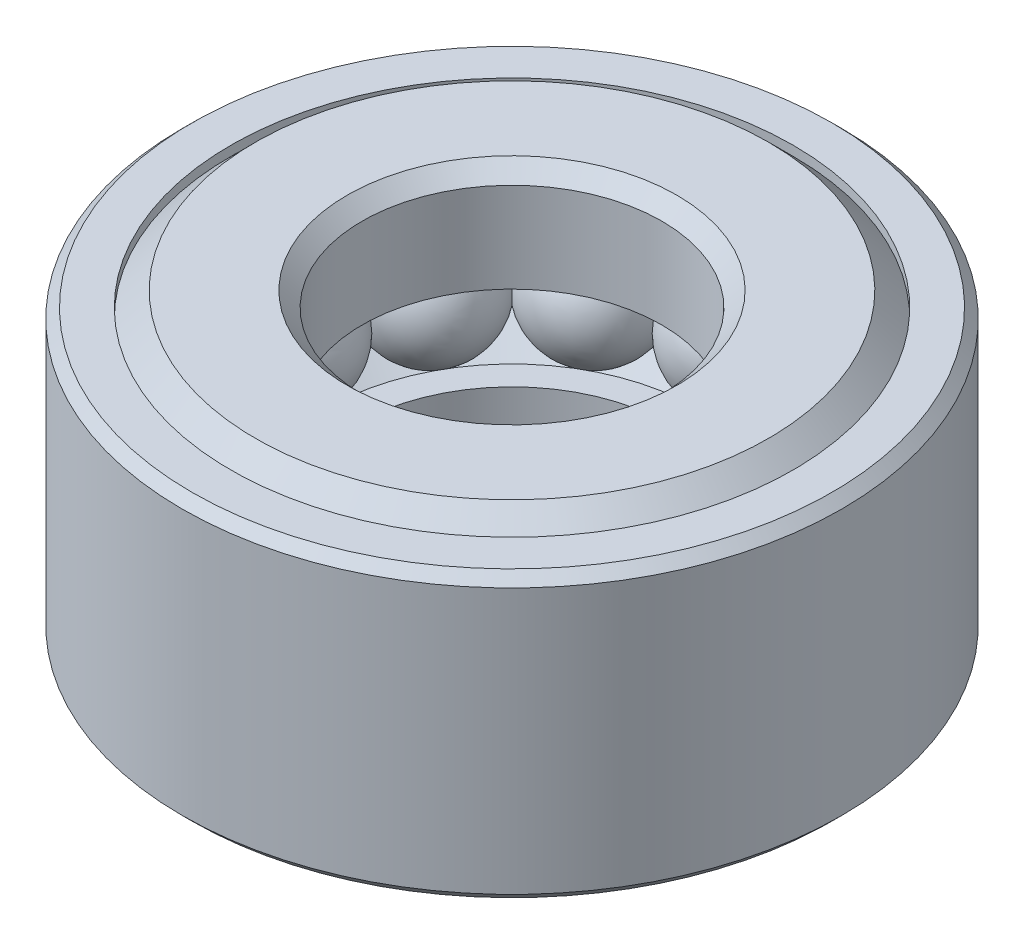
ISO-10303-21;
HEADER;
FILE_DESCRIPTION(('STEP AP214'),'2;1');
FILE_NAME('part.step','',(''),(''),'','','');
FILE_SCHEMA(('AUTOMOTIVE_DESIGN { 1 0 10303 214 1 1 1 1 }'));
ENDSEC;
DATA;
#1=APPLICATION_CONTEXT('core data for automotive mechanical design processes');
#2=APPLICATION_PROTOCOL_DEFINITION('international standard','automotive_design',2000,#1);
#3=PRODUCT_CONTEXT('',#1,'mechanical');
#4=PRODUCT('Part','Part','',(#3));
#5=PRODUCT_RELATED_PRODUCT_CATEGORY('part','',(#4));
#6=PRODUCT_DEFINITION_FORMATION('','',#4);
#7=PRODUCT_DEFINITION_CONTEXT('part definition',#1,'design');
#8=PRODUCT_DEFINITION('design','',#6,#7);
#9=PRODUCT_DEFINITION_SHAPE('','',#8);
#10=(LENGTH_UNIT() NAMED_UNIT(*) SI_UNIT(.MILLI.,.METRE.));
#11=(NAMED_UNIT(*) PLANE_ANGLE_UNIT() SI_UNIT($,.RADIAN.));
#12=(NAMED_UNIT(*) SI_UNIT($,.STERADIAN.) SOLID_ANGLE_UNIT());
#13=UNCERTAINTY_MEASURE_WITH_UNIT(LENGTH_MEASURE(1.E-05),#10,'distance_accuracy_value','');
#14=(GEOMETRIC_REPRESENTATION_CONTEXT(3) GLOBAL_UNCERTAINTY_ASSIGNED_CONTEXT((#13)) GLOBAL_UNIT_ASSIGNED_CONTEXT((#10,
#11,#12)) REPRESENTATION_CONTEXT('',''));
#15=CARTESIAN_POINT('',(0.,0.,0.));
#16=DIRECTION('',(0.,0.,1.));
#17=DIRECTION('',(1.,0.,0.));
#18=AXIS2_PLACEMENT_3D('',#15,#16,#17);
#19=CARTESIAN_POINT('',(0.,3.571875,7.44798137163755));
#20=DIRECTION('',(0.,-1.,0.));
#21=DIRECTION('',(0.,0.,-1.));
#22=AXIS2_PLACEMENT_3D('',#19,#20,#21);
#23=PLANE('',#22);
#24=CARTESIAN_POINT('',(0.,3.571875,0.));
#25=DIRECTION('',(0.,-1.,0.));
#26=DIRECTION('',(0.,0.,-1.));
#27=AXIS2_PLACEMENT_3D('',#24,#25,#26);
#28=CIRCLE('',#27,8.47484407539469);
#29=CARTESIAN_POINT('',(0.,3.571875,-8.47484407539469));
#30=VERTEX_POINT('',#29);
#31=EDGE_CURVE('E11',#30,#30,#28,.T.);
#32=ORIENTED_EDGE('',*,*,#31,.F.);
#33=EDGE_LOOP('',(#32));
#34=FACE_BOUND('',#33,.T.);
#35=CARTESIAN_POINT('',(0.,3.571875,0.));
#36=DIRECTION('',(0.,-1.,0.));
#37=DIRECTION('',(0.,0.,-1.));
#38=AXIS2_PLACEMENT_3D('',#35,#36,#37);
#39=CIRCLE('',#38,7.44798137163755);
#40=CARTESIAN_POINT('',(0.,3.571875,-7.44798137163755));
#41=VERTEX_POINT('',#40);
#42=EDGE_CURVE('E69',#41,#41,#39,.T.);
#43=ORIENTED_EDGE('',*,*,#42,.T.);
#44=EDGE_LOOP('',(#43));
#45=FACE_BOUND('',#44,.T.);
#46=ADVANCED_FACE('F41',(#34,#45),#23,.F.);
#47=CARTESIAN_POINT('',(0.,3.571875,0.));
#48=DIRECTION('',(0.,-1.,0.));
#49=DIRECTION('',(0.,0.,-1.));
#50=AXIS2_PLACEMENT_3D('',#47,#48,#49);
#51=CONICAL_SURFACE('',#50,8.47484407539469,0.78539816339745);
#52=CARTESIAN_POINT('',(0.,3.31546907539469,0.));
#53=DIRECTION('',(0.,-1.,0.));
#54=DIRECTION('',(0.,0.,-1.));
#55=AXIS2_PLACEMENT_3D('',#52,#53,#54);
#56=CIRCLE('',#55,8.73125);
#57=CARTESIAN_POINT('',(0.,3.31546907539469,-8.73125));
#58=VERTEX_POINT('',#57);
#59=EDGE_CURVE('E47',#58,#58,#56,.T.);
#60=ORIENTED_EDGE('',*,*,#59,.F.);
#61=EDGE_LOOP('',(#60));
#62=FACE_BOUND('',#61,.T.);
#63=ORIENTED_EDGE('',*,*,#31,.T.);
#64=EDGE_LOOP('',(#63));
#65=FACE_BOUND('',#64,.T.);
#66=ADVANCED_FACE('F106',(#62,#65),#51,.T.);
#67=CARTESIAN_POINT('',(0.,-3.96875,0.));
#68=DIRECTION('',(0.,-1.,0.));
#69=DIRECTION('',(0.,0.,-1.));
#70=AXIS2_PLACEMENT_3D('',#67,#68,#69);
#71=CYLINDRICAL_SURFACE('',#70,8.73125);
#72=CARTESIAN_POINT('',(0.,-3.71234407539469,0.));
#73=DIRECTION('',(0.,-1.,0.));
#74=DIRECTION('',(0.,0.,-1.));
#75=AXIS2_PLACEMENT_3D('',#72,#73,#74);
#76=CIRCLE('',#75,8.73125);
#77=CARTESIAN_POINT('',(0.,-3.71234407539469,-8.73125));
#78=VERTEX_POINT('',#77);
#79=EDGE_CURVE('E51',#78,#78,#76,.T.);
#80=ORIENTED_EDGE('',*,*,#79,.F.);
#81=EDGE_LOOP('',(#80));
#82=FACE_BOUND('',#81,.T.);
#83=ORIENTED_EDGE('',*,*,#59,.T.);
#84=EDGE_LOOP('',(#83));
#85=FACE_BOUND('',#84,.T.);
#86=ADVANCED_FACE('F101',(#82,#85),#71,.T.);
#87=CARTESIAN_POINT('',(0.,-3.71234407539469,0.));
#88=DIRECTION('',(0.,1.,0.));
#89=DIRECTION('',(0.,0.,1.));
#90=AXIS2_PLACEMENT_3D('',#87,#88,#89);
#91=CONICAL_SURFACE('',#90,8.73125,0.78539816339745);
#92=CARTESIAN_POINT('',(0.,-3.96875,0.));
#93=DIRECTION('',(0.,-1.,0.));
#94=DIRECTION('',(0.,0.,-1.));
#95=AXIS2_PLACEMENT_3D('',#92,#93,#94);
#96=CIRCLE('',#95,8.47484407539468);
#97=CARTESIAN_POINT('',(0.,-3.96875,-8.47484407539468));
#98=VERTEX_POINT('',#97);
#99=EDGE_CURVE('E55',#98,#98,#96,.T.);
#100=ORIENTED_EDGE('',*,*,#99,.F.);
#101=EDGE_LOOP('',(#100));
#102=FACE_BOUND('',#101,.T.);
#103=ORIENTED_EDGE('',*,*,#79,.T.);
#104=EDGE_LOOP('',(#103));
#105=FACE_BOUND('',#104,.T.);
#106=ADVANCED_FACE('F95',(#102,#105),#91,.T.);
#107=CARTESIAN_POINT('',(0.,-3.96875,8.47484407539468));
#108=DIRECTION('',(0.,1.,0.));
#109=DIRECTION('',(0.,0.,1.));
#110=AXIS2_PLACEMENT_3D('',#107,#108,#109);
#111=PLANE('',#110);
#112=CARTESIAN_POINT('',(0.,-3.96875,0.));
#113=DIRECTION('',(0.,-1.,0.));
#114=DIRECTION('',(0.,0.,-1.));
#115=AXIS2_PLACEMENT_3D('',#112,#113,#114);
#116=CIRCLE('',#115,8.03275);
#117=CARTESIAN_POINT('',(0.,-3.96875,-8.03275));
#118=VERTEX_POINT('',#117);
#119=EDGE_CURVE('E60',#118,#118,#116,.T.);
#120=ORIENTED_EDGE('',*,*,#119,.F.);
#121=EDGE_LOOP('',(#120));
#122=FACE_BOUND('',#121,.T.);
#123=ORIENTED_EDGE('',*,*,#99,.T.);
#124=EDGE_LOOP('',(#123));
#125=FACE_BOUND('',#124,.T.);
#126=ADVANCED_FACE('F89',(#122,#125),#111,.F.);
#127=CARTESIAN_POINT('',(0.,-3.96875,0.));
#128=DIRECTION('',(0.,-1.,0.));
#129=DIRECTION('',(0.,0.,-1.));
#130=AXIS2_PLACEMENT_3D('',#127,#128,#129);
#131=CYLINDRICAL_SURFACE('',#130,8.03275);
#132=CARTESIAN_POINT('',(0.,3.31546907539469,0.));
#133=DIRECTION('',(0.,-1.,0.));
#134=DIRECTION('',(0.,0.,-1.));
#135=AXIS2_PLACEMENT_3D('',#132,#133,#134);
#136=CIRCLE('',#135,8.03275);
#137=CARTESIAN_POINT('',(0.,3.31546907539469,-8.03275));
#138=VERTEX_POINT('',#137);
#139=EDGE_CURVE('E63',#138,#138,#136,.T.);
#140=ORIENTED_EDGE('',*,*,#139,.F.);
#141=EDGE_LOOP('',(#140));
#142=FACE_BOUND('',#141,.T.);
#143=ORIENTED_EDGE('',*,*,#119,.T.);
#144=EDGE_LOOP('',(#143));
#145=FACE_BOUND('',#144,.T.);
#146=ADVANCED_FACE('F83',(#142,#145),#131,.F.);
#147=CARTESIAN_POINT('',(0.,3.31546907539469,7.44798137163755));
#148=DIRECTION('',(0.,1.,0.));
#149=DIRECTION('',(0.,0.,1.));
#150=AXIS2_PLACEMENT_3D('',#147,#148,#149);
#151=PLANE('',#150);
#152=CARTESIAN_POINT('',(0.,3.31546907539469,0.));
#153=DIRECTION('',(0.,-1.,0.));
#154=DIRECTION('',(0.,0.,-1.));
#155=AXIS2_PLACEMENT_3D('',#152,#153,#154);
#156=CIRCLE('',#155,7.44798137163755);
#157=CARTESIAN_POINT('',(0.,3.31546907539469,-7.44798137163755));
#158=VERTEX_POINT('',#157);
#159=EDGE_CURVE('E66',#158,#158,#156,.T.);
#160=ORIENTED_EDGE('',*,*,#159,.F.);
#161=EDGE_LOOP('',(#160));
#162=FACE_BOUND('',#161,.T.);
#163=ORIENTED_EDGE('',*,*,#139,.T.);
#164=EDGE_LOOP('',(#163));
#165=FACE_BOUND('',#164,.T.);
#166=ADVANCED_FACE('F77',(#162,#165),#151,.F.);
#167=CARTESIAN_POINT('',(0.,-3.96875,0.));
#168=DIRECTION('',(0.,-1.,0.));
#169=DIRECTION('',(0.,0.,-1.));
#170=AXIS2_PLACEMENT_3D('',#167,#168,#169);
#171=CYLINDRICAL_SURFACE('',#170,7.44798137163755);
#172=ORIENTED_EDGE('',*,*,#42,.F.);
#173=EDGE_LOOP('',(#172));
#174=FACE_BOUND('',#173,.T.);
#175=ORIENTED_EDGE('',*,*,#159,.T.);
#176=EDGE_LOOP('',(#175));
#177=FACE_BOUND('',#176,.T.);
#178=ADVANCED_FACE('F74',(#174,#177),#171,.F.);
#179=CLOSED_SHELL('',(#46,#66,#86,#106,#126,#146,#166,#178));
#180=MANIFOLD_SOLID_BREP('B2',#179);
#181=CARTESIAN_POINT('',(-2.97854687499993,0.,5.15899452022554));
#182=DIRECTION('',(0.,1.,0.));
#183=DIRECTION('',(0.499999999999989,0.,-0.866025403784445));
#184=AXIS2_PLACEMENT_3D('',#181,#182,#183);
#185=SPHERICAL_SURFACE('',#184,1.5875);
#186=CARTESIAN_POINT('',(-2.97854687499993,1.5875,5.15899452022554));
#187=VERTEX_POINT('',#186);
#188=VERTEX_LOOP('',#187);
#189=FACE_BOUND('',#188,.T.);
#190=ADVANCED_FACE('F168',(#189),#185,.T.);
#191=CLOSED_SHELL('',(#190));
#192=MANIFOLD_SOLID_BREP('B6',#191);
#193=CARTESIAN_POINT('',(-5.15899452022547,0.,2.97854687500006));
#194=DIRECTION('',(0.,1.,0.));
#195=DIRECTION('',(0.866025403784433,0.,-0.50000000000001));
#196=AXIS2_PLACEMENT_3D('',#193,#194,#195);
#197=SPHERICAL_SURFACE('',#196,1.5875);
#198=CARTESIAN_POINT('',(-5.15899452022547,1.5875,2.97854687500006));
#199=VERTEX_POINT('',#198);
#200=VERTEX_LOOP('',#199);
#201=FACE_BOUND('',#200,.T.);
#202=ADVANCED_FACE('F186',(#201),#197,.T.);
#203=CLOSED_SHELL('',(#202));
#204=MANIFOLD_SOLID_BREP('B37',#203);
#205=CARTESIAN_POINT('',(-5.95709375,0.,0.));
#206=DIRECTION('',(0.,1.,0.));
#207=DIRECTION('',(1.,0.,0.));
#208=AXIS2_PLACEMENT_3D('',#205,#206,#207);
#209=SPHERICAL_SURFACE('',#208,1.5875);
#210=CARTESIAN_POINT('',(-5.95709375,1.5875,0.));
#211=VERTEX_POINT('',#210);
#212=VERTEX_LOOP('',#211);
#213=FACE_BOUND('',#212,.T.);
#214=ADVANCED_FACE('F204',(#213),#209,.T.);
#215=CLOSED_SHELL('',(#214));
#216=MANIFOLD_SOLID_BREP('B164',#215);
#217=CARTESIAN_POINT('',(-5.15899452022553,0.,-2.97854687499995));
#218=DIRECTION('',(0.,1.,0.));
#219=DIRECTION('',(0.866025403784443,0.,0.499999999999992));
#220=AXIS2_PLACEMENT_3D('',#217,#218,#219);
#221=SPHERICAL_SURFACE('',#220,1.5875);
#222=CARTESIAN_POINT('',(-5.15899452022553,1.5875,-2.97854687499995));
#223=VERTEX_POINT('',#222);
#224=VERTEX_LOOP('',#223);
#225=FACE_BOUND('',#224,.T.);
#226=ADVANCED_FACE('F237',(#225),#221,.T.);
#227=CLOSED_SHELL('',(#226));
#228=MANIFOLD_SOLID_BREP('B182',#227);
#229=CARTESIAN_POINT('',(-2.97854687500004,0.,-5.15899452022548));
#230=DIRECTION('',(0.,1.,0.));
#231=DIRECTION('',(0.500000000000007,0.,0.866025403784435));
#232=AXIS2_PLACEMENT_3D('',#229,#230,#231);
#233=SPHERICAL_SURFACE('',#232,1.5875);
#234=CARTESIAN_POINT('',(-2.97854687500004,1.5875,-5.15899452022548));
#235=VERTEX_POINT('',#234);
#236=VERTEX_LOOP('',#235);
#237=FACE_BOUND('',#236,.T.);
#238=ADVANCED_FACE('F270',(#237),#233,.T.);
#239=CLOSED_SHELL('',(#238));
#240=MANIFOLD_SOLID_BREP('B200',#239);
#241=CARTESIAN_POINT('',(0.,0.,-5.95709375));
#242=DIRECTION('',(0.,1.,0.));
#243=DIRECTION('',(0.,0.,1.));
#244=AXIS2_PLACEMENT_3D('',#241,#242,#243);
#245=SPHERICAL_SURFACE('',#244,1.5875);
#246=CARTESIAN_POINT('',(0.,1.5875,-5.95709375));
#247=VERTEX_POINT('',#246);
#248=VERTEX_LOOP('',#247);
#249=FACE_BOUND('',#248,.T.);
#250=ADVANCED_FACE('F303',(#249),#245,.T.);
#251=CLOSED_SHELL('',(#250));
#252=MANIFOLD_SOLID_BREP('B233',#251);
#253=CARTESIAN_POINT('',(2.97854687499997,0.,-5.15899452022552));
#254=DIRECTION('',(0.,1.,0.));
#255=DIRECTION('',(-0.499999999999995,0.,0.866025403784442));
#256=AXIS2_PLACEMENT_3D('',#253,#254,#255);
#257=SPHERICAL_SURFACE('',#256,1.5875);
#258=CARTESIAN_POINT('',(2.97854687499997,1.5875,-5.15899452022552));
#259=VERTEX_POINT('',#258);
#260=VERTEX_LOOP('',#259);
#261=FACE_BOUND('',#260,.T.);
#262=ADVANCED_FACE('F336',(#261),#257,.T.);
#263=CLOSED_SHELL('',(#262));
#264=MANIFOLD_SOLID_BREP('B266',#263);
#265=CARTESIAN_POINT('',(5.15899452022549,0.,-2.97854687500002));
#266=DIRECTION('',(0.,1.,0.));
#267=DIRECTION('',(-0.866025403784436,0.,0.500000000000004));
#268=AXIS2_PLACEMENT_3D('',#265,#266,#267);
#269=SPHERICAL_SURFACE('',#268,1.5875);
#270=CARTESIAN_POINT('',(5.15899452022549,1.5875,-2.97854687500002));
#271=VERTEX_POINT('',#270);
#272=VERTEX_LOOP('',#271);
#273=FACE_BOUND('',#272,.T.);
#274=ADVANCED_FACE('F369',(#273),#269,.T.);
#275=CLOSED_SHELL('',(#274));
#276=MANIFOLD_SOLID_BREP('B299',#275);
#277=CARTESIAN_POINT('',(5.95709375,0.,0.));
#278=DIRECTION('',(0.,1.,0.));
#279=DIRECTION('',(-1.,0.,0.));
#280=AXIS2_PLACEMENT_3D('',#277,#278,#279);
#281=SPHERICAL_SURFACE('',#280,1.5875);
#282=CARTESIAN_POINT('',(5.95709375,1.5875,0.));
#283=VERTEX_POINT('',#282);
#284=VERTEX_LOOP('',#283);
#285=FACE_BOUND('',#284,.T.);
#286=ADVANCED_FACE('F402',(#285),#281,.T.);
#287=CLOSED_SHELL('',(#286));
#288=MANIFOLD_SOLID_BREP('B332',#287);
#289=CARTESIAN_POINT('',(5.15899452022551,0.,2.97854687499999));
#290=DIRECTION('',(0.,1.,0.));
#291=DIRECTION('',(-0.86602540378444,0.,-0.499999999999998));
#292=AXIS2_PLACEMENT_3D('',#289,#290,#291);
#293=SPHERICAL_SURFACE('',#292,1.5875);
#294=CARTESIAN_POINT('',(5.15899452022551,1.5875,2.97854687499999));
#295=VERTEX_POINT('',#294);
#296=VERTEX_LOOP('',#295);
#297=FACE_BOUND('',#296,.T.);
#298=ADVANCED_FACE('F435',(#297),#293,.T.);
#299=CLOSED_SHELL('',(#298));
#300=MANIFOLD_SOLID_BREP('B365',#299);
#301=CARTESIAN_POINT('',(2.97854687500001,0.,5.1589945202255));
#302=DIRECTION('',(0.,1.,0.));
#303=DIRECTION('',(-0.500000000000001,0.,-0.866025403784438));
#304=AXIS2_PLACEMENT_3D('',#301,#302,#303);
#305=SPHERICAL_SURFACE('',#304,1.5875);
#306=CARTESIAN_POINT('',(2.97854687500001,1.5875,5.1589945202255));
#307=VERTEX_POINT('',#306);
#308=VERTEX_LOOP('',#307);
#309=FACE_BOUND('',#308,.T.);
#310=ADVANCED_FACE('F468',(#309),#305,.T.);
#311=CLOSED_SHELL('',(#310));
#312=MANIFOLD_SOLID_BREP('B398',#311);
#313=CARTESIAN_POINT('',(0.,0.,5.95709375));
#314=DIRECTION('',(0.,1.,0.));
#315=DIRECTION('',(0.,0.,-1.));
#316=AXIS2_PLACEMENT_3D('',#313,#314,#315);
#317=SPHERICAL_SURFACE('',#316,1.5875);
#318=CARTESIAN_POINT('',(0.,1.5875,5.95709375));
#319=VERTEX_POINT('',#318);
#320=VERTEX_LOOP('',#319);
#321=FACE_BOUND('',#320,.T.);
#322=ADVANCED_FACE('F503',(#321),#317,.T.);
#323=CLOSED_SHELL('',(#322));
#324=MANIFOLD_SOLID_BREP('B431',#323);
#325=CARTESIAN_POINT('',(0.,3.57187500000001,0.));
#326=DIRECTION('',(0.,1.,0.));
#327=DIRECTION('',(0.,0.,1.));
#328=AXIS2_PLACEMENT_3D('',#325,#326,#327);
#329=CONICAL_SURFACE('',#328,3.96875,0.785398163397452);
#330=CARTESIAN_POINT('',(0.,3.96874999999999,0.));
#331=DIRECTION('',(0.,-1.,0.));
#332=DIRECTION('',(0.,0.,-1.));
#333=AXIS2_PLACEMENT_3D('',#330,#331,#332);
#334=CIRCLE('',#333,4.36562499999999);
#335=CARTESIAN_POINT('',(0.,3.96874999999999,-4.36562499999999));
#336=VERTEX_POINT('',#335);
#337=EDGE_CURVE('E502',#336,#336,#334,.T.);
#338=ORIENTED_EDGE('',*,*,#337,.F.);
#339=EDGE_LOOP('',(#338));
#340=FACE_BOUND('',#339,.T.);
#341=CARTESIAN_POINT('',(0.,3.57187500000001,0.));
#342=DIRECTION('',(0.,-1.,0.));
#343=DIRECTION('',(0.,0.,-1.));
#344=AXIS2_PLACEMENT_3D('',#341,#342,#343);
#345=CIRCLE('',#344,3.96875);
#346=CARTESIAN_POINT('',(0.,3.57187500000001,-3.96875));
#347=VERTEX_POINT('',#346);
#348=EDGE_CURVE('E553',#347,#347,#345,.T.);
#349=ORIENTED_EDGE('',*,*,#348,.T.);
#350=EDGE_LOOP('',(#349));
#351=FACE_BOUND('',#350,.T.);
#352=ADVANCED_FACE('F522',(#340,#351),#329,.F.);
#353=CARTESIAN_POINT('',(0.,3.96875,6.79470044703224));
#354=DIRECTION('',(0.,-1.,0.));
#355=DIRECTION('',(0.,0.,-1.));
#356=AXIS2_PLACEMENT_3D('',#353,#354,#355);
#357=PLANE('',#356);
#358=CARTESIAN_POINT('',(0.,3.96875,0.));
#359=DIRECTION('',(0.,-1.,0.));
#360=DIRECTION('',(0.,0.,-1.));
#361=AXIS2_PLACEMENT_3D('',#358,#359,#360);
#362=CIRCLE('',#361,6.79470044703224);
#363=CARTESIAN_POINT('',(0.,3.96875,-6.79470044703224));
#364=VERTEX_POINT('',#363);
#365=EDGE_CURVE('E528',#364,#364,#362,.T.);
#366=ORIENTED_EDGE('',*,*,#365,.F.);
#367=EDGE_LOOP('',(#366));
#368=FACE_BOUND('',#367,.T.);
#369=ORIENTED_EDGE('',*,*,#337,.T.);
#370=EDGE_LOOP('',(#369));
#371=FACE_BOUND('',#370,.T.);
#372=ADVANCED_FACE('F596',(#368,#371),#357,.F.);
#373=CARTESIAN_POINT('',(0.,3.96875,0.));
#374=DIRECTION('',(0.,-1.,0.));
#375=DIRECTION('',(0.,0.,-1.));
#376=AXIS2_PLACEMENT_3D('',#373,#374,#375);
#377=CONICAL_SURFACE('',#376,6.79470044703224,0.785398163397451);
#378=CARTESIAN_POINT('',(0.,2.81801294703224,0.));
#379=DIRECTION('',(0.,-1.,0.));
#380=DIRECTION('',(0.,0.,-1.));
#381=AXIS2_PLACEMENT_3D('',#378,#379,#380);
#382=CIRCLE('',#381,7.9454375);
#383=CARTESIAN_POINT('',(0.,2.81801294703224,-7.9454375));
#384=VERTEX_POINT('',#383);
#385=EDGE_CURVE('E532',#384,#384,#382,.T.);
#386=ORIENTED_EDGE('',*,*,#385,.F.);
#387=EDGE_LOOP('',(#386));
#388=FACE_BOUND('',#387,.T.);
#389=ORIENTED_EDGE('',*,*,#365,.T.);
#390=EDGE_LOOP('',(#389));
#391=FACE_BOUND('',#390,.T.);
#392=ADVANCED_FACE('F591',(#388,#391),#377,.T.);
#393=CARTESIAN_POINT('',(0.,-3.96875,0.));
#394=DIRECTION('',(0.,-1.,0.));
#395=DIRECTION('',(0.,0.,-1.));
#396=AXIS2_PLACEMENT_3D('',#393,#394,#395);
#397=CYLINDRICAL_SURFACE('',#396,7.9454375);
#398=CARTESIAN_POINT('',(0.,1.190625,0.));
#399=DIRECTION('',(0.,-1.,0.));
#400=DIRECTION('',(0.,0.,-1.));
#401=AXIS2_PLACEMENT_3D('',#398,#399,#400);
#402=CIRCLE('',#401,7.9454375);
#403=CARTESIAN_POINT('',(0.,1.190625,-7.9454375));
#404=VERTEX_POINT('',#403);
#405=EDGE_CURVE('E536',#404,#404,#402,.T.);
#406=ORIENTED_EDGE('',*,*,#405,.F.);
#407=EDGE_LOOP('',(#406));
#408=FACE_BOUND('',#407,.T.);
#409=ORIENTED_EDGE('',*,*,#385,.T.);
#410=EDGE_LOOP('',(#409));
#411=FACE_BOUND('',#410,.T.);
#412=ADVANCED_FACE('F585',(#408,#411),#397,.T.);
#413=CARTESIAN_POINT('',(0.,1.190625,7.00712630157876));
#414=DIRECTION('',(0.,1.,0.));
#415=DIRECTION('',(0.,0.,1.));
#416=AXIS2_PLACEMENT_3D('',#413,#414,#415);
#417=PLANE('',#416);
#418=CARTESIAN_POINT('',(0.,1.190625,0.));
#419=DIRECTION('',(0.,-1.,0.));
#420=DIRECTION('',(0.,0.,-1.));
#421=AXIS2_PLACEMENT_3D('',#418,#419,#420);
#422=CIRCLE('',#421,7.00712630157876);
#423=CARTESIAN_POINT('',(0.,1.190625,-7.00712630157876));
#424=VERTEX_POINT('',#423);
#425=EDGE_CURVE('E541',#424,#424,#422,.T.);
#426=ORIENTED_EDGE('',*,*,#425,.F.);
#427=EDGE_LOOP('',(#426));
#428=FACE_BOUND('',#427,.T.);
#429=ORIENTED_EDGE('',*,*,#405,.T.);
#430=EDGE_LOOP('',(#429));
#431=FACE_BOUND('',#430,.T.);
#432=ADVANCED_FACE('F579',(#428,#431),#417,.F.);
#433=CARTESIAN_POINT('',(0.,1.190625,0.));
#434=DIRECTION('',(0.,-1.,0.));
#435=DIRECTION('',(0.,0.,-1.));
#436=AXIS2_PLACEMENT_3D('',#433,#434,#435);
#437=CONICAL_SURFACE('',#436,7.00712630157876,0.848062078981481);
#438=CARTESIAN_POINT('',(0.,2.11666666666667,0.));
#439=DIRECTION('',(0.,-1.,0.));
#440=DIRECTION('',(0.,0.,-1.));
#441=AXIS2_PLACEMENT_3D('',#438,#439,#440);
#442=CIRCLE('',#441,5.95709375);
#443=CARTESIAN_POINT('',(0.,2.11666666666667,-5.95709375));
#444=VERTEX_POINT('',#443);
#445=EDGE_CURVE('E544',#444,#444,#442,.T.);
#446=ORIENTED_EDGE('',*,*,#445,.F.);
#447=EDGE_LOOP('',(#446));
#448=FACE_BOUND('',#447,.T.);
#449=ORIENTED_EDGE('',*,*,#425,.T.);
#450=EDGE_LOOP('',(#449));
#451=FACE_BOUND('',#450,.T.);
#452=ADVANCED_FACE('F573',(#448,#451),#437,.F.);
#453=CARTESIAN_POINT('',(0.,2.11666666666667,0.));
#454=DIRECTION('',(0.,1.,0.));
#455=DIRECTION('',(0.,0.,1.));
#456=AXIS2_PLACEMENT_3D('',#453,#454,#455);
#457=CONICAL_SURFACE('',#456,5.95709375,0.848062078981481);
#458=CARTESIAN_POINT('',(0.,1.190625,0.));
#459=DIRECTION('',(0.,-1.,0.));
#460=DIRECTION('',(0.,0.,-1.));
#461=AXIS2_PLACEMENT_3D('',#458,#459,#460);
#462=CIRCLE('',#461,4.90706119842124);
#463=CARTESIAN_POINT('',(0.,1.190625,-4.90706119842124));
#464=VERTEX_POINT('',#463);
#465=EDGE_CURVE('E547',#464,#464,#462,.T.);
#466=ORIENTED_EDGE('',*,*,#465,.F.);
#467=EDGE_LOOP('',(#466));
#468=FACE_BOUND('',#467,.T.);
#469=ORIENTED_EDGE('',*,*,#445,.T.);
#470=EDGE_LOOP('',(#469));
#471=FACE_BOUND('',#470,.T.);
#472=ADVANCED_FACE('F567',(#468,#471),#457,.T.);
#473=CARTESIAN_POINT('',(0.,1.190625,3.96875));
#474=DIRECTION('',(0.,1.,0.));
#475=DIRECTION('',(0.,0.,1.));
#476=AXIS2_PLACEMENT_3D('',#473,#474,#475);
#477=PLANE('',#476);
#478=CARTESIAN_POINT('',(0.,1.190625,0.));
#479=DIRECTION('',(0.,-1.,0.));
#480=DIRECTION('',(0.,0.,-1.));
#481=AXIS2_PLACEMENT_3D('',#478,#479,#480);
#482=CIRCLE('',#481,3.96875);
#483=CARTESIAN_POINT('',(0.,1.190625,-3.96875));
#484=VERTEX_POINT('',#483);
#485=EDGE_CURVE('E550',#484,#484,#482,.T.);
#486=ORIENTED_EDGE('',*,*,#485,.F.);
#487=EDGE_LOOP('',(#486));
#488=FACE_BOUND('',#487,.T.);
#489=ORIENTED_EDGE('',*,*,#465,.T.);
#490=EDGE_LOOP('',(#489));
#491=FACE_BOUND('',#490,.T.);
#492=ADVANCED_FACE('F561',(#488,#491),#477,.F.);
#493=CARTESIAN_POINT('',(0.,-3.96875,0.));
#494=DIRECTION('',(0.,-1.,0.));
#495=DIRECTION('',(0.,0.,-1.));
#496=AXIS2_PLACEMENT_3D('',#493,#494,#495);
#497=CYLINDRICAL_SURFACE('',#496,3.96875);
#498=ORIENTED_EDGE('',*,*,#348,.F.);
#499=EDGE_LOOP('',(#498));
#500=FACE_BOUND('',#499,.T.);
#501=ORIENTED_EDGE('',*,*,#485,.T.);
#502=EDGE_LOOP('',(#501));
#503=FACE_BOUND('',#502,.T.);
#504=ADVANCED_FACE('F558',(#500,#503),#497,.F.);
#505=CLOSED_SHELL('',(#352,#372,#392,#412,#432,#452,#472,#492,#504));
#506=MANIFOLD_SOLID_BREP('B464',#505);
#507=CARTESIAN_POINT('',(0.,-1.190625,8.03275));
#508=DIRECTION('',(0.,-1.,0.));
#509=DIRECTION('',(0.,0.,-1.));
#510=AXIS2_PLACEMENT_3D('',#507,#508,#509);
#511=PLANE('',#510);
#512=CARTESIAN_POINT('',(0.,-1.190625,0.));
#513=DIRECTION('',(0.,-1.,0.));
#514=DIRECTION('',(0.,0.,-1.));
#515=AXIS2_PLACEMENT_3D('',#512,#513,#514);
#516=CIRCLE('',#515,8.03275);
#517=CARTESIAN_POINT('',(0.,-1.190625,-8.03275));
#518=VERTEX_POINT('',#517);
#519=EDGE_CURVE('E689',#518,#518,#516,.T.);
#520=ORIENTED_EDGE('',*,*,#519,.F.);
#521=EDGE_LOOP('',(#520));
#522=FACE_BOUND('',#521,.T.);
#523=CARTESIAN_POINT('',(0.,-1.190625,0.));
#524=DIRECTION('',(0.,-1.,0.));
#525=DIRECTION('',(0.,0.,-1.));
#526=AXIS2_PLACEMENT_3D('',#523,#524,#525);
#527=CIRCLE('',#526,7.00712630157876);
#528=CARTESIAN_POINT('',(0.,-1.190625,-7.00712630157876));
#529=VERTEX_POINT('',#528);
#530=EDGE_CURVE('E521',#529,#529,#527,.T.);
#531=ORIENTED_EDGE('',*,*,#530,.T.);
#532=EDGE_LOOP('',(#531));
#533=FACE_BOUND('',#532,.T.);
#534=ADVANCED_FACE('F658',(#522,#533),#511,.F.);
#535=CARTESIAN_POINT('',(0.,-2.11666666666667,0.));
#536=DIRECTION('',(0.,1.,0.));
#537=DIRECTION('',(0.,0.,1.));
#538=AXIS2_PLACEMENT_3D('',#535,#536,#537);
#539=CONICAL_SURFACE('',#538,5.95709375,0.848062078981481);
#540=ORIENTED_EDGE('',*,*,#530,.F.);
#541=EDGE_LOOP('',(#540));
#542=FACE_BOUND('',#541,.T.);
#543=CARTESIAN_POINT('',(0.,-2.11666666666667,0.));
#544=DIRECTION('',(0.,-1.,0.));
#545=DIRECTION('',(0.,0.,-1.));
#546=AXIS2_PLACEMENT_3D('',#543,#544,#545);
#547=CIRCLE('',#546,5.95709375);
#548=CARTESIAN_POINT('',(0.,-2.11666666666667,-5.95709375));
#549=VERTEX_POINT('',#548);
#550=EDGE_CURVE('E664',#549,#549,#547,.T.);
#551=ORIENTED_EDGE('',*,*,#550,.T.);
#552=EDGE_LOOP('',(#551));
#553=FACE_BOUND('',#552,.T.);
#554=ADVANCED_FACE('F696',(#542,#553),#539,.F.);
#555=CARTESIAN_POINT('',(0.,-1.190625,0.));
#556=DIRECTION('',(0.,-1.,0.));
#557=DIRECTION('',(0.,0.,-1.));
#558=AXIS2_PLACEMENT_3D('',#555,#556,#557);
#559=CONICAL_SURFACE('',#558,4.90706119842124,0.848062078981481);
#560=ORIENTED_EDGE('',*,*,#550,.F.);
#561=EDGE_LOOP('',(#560));
#562=FACE_BOUND('',#561,.T.);
#563=CARTESIAN_POINT('',(0.,-1.190625,0.));
#564=DIRECTION('',(0.,-1.,0.));
#565=DIRECTION('',(0.,0.,-1.));
#566=AXIS2_PLACEMENT_3D('',#563,#564,#565);
#567=CIRCLE('',#566,4.90706119842124);
#568=CARTESIAN_POINT('',(0.,-1.190625,-4.90706119842124));
#569=VERTEX_POINT('',#568);
#570=EDGE_CURVE('E668',#569,#569,#567,.T.);
#571=ORIENTED_EDGE('',*,*,#570,.T.);
#572=EDGE_LOOP('',(#571));
#573=FACE_BOUND('',#572,.T.);
#574=ADVANCED_FACE('F700',(#562,#573),#559,.T.);
#575=CARTESIAN_POINT('',(0.,-1.190625,4.1656));
#576=DIRECTION('',(0.,-1.,0.));
#577=DIRECTION('',(0.,0.,-1.));
#578=AXIS2_PLACEMENT_3D('',#575,#576,#577);
#579=PLANE('',#578);
#580=ORIENTED_EDGE('',*,*,#570,.F.);
#581=EDGE_LOOP('',(#580));
#582=FACE_BOUND('',#581,.T.);
#583=CARTESIAN_POINT('',(0.,-1.190625,0.));
#584=DIRECTION('',(0.,-1.,0.));
#585=DIRECTION('',(0.,0.,-1.));
#586=AXIS2_PLACEMENT_3D('',#583,#584,#585);
#587=CIRCLE('',#586,4.1656);
#588=CARTESIAN_POINT('',(0.,-1.190625,-4.1656));
#589=VERTEX_POINT('',#588);
#590=EDGE_CURVE('E672',#589,#589,#587,.T.);
#591=ORIENTED_EDGE('',*,*,#590,.T.);
#592=EDGE_LOOP('',(#591));
#593=FACE_BOUND('',#592,.T.);
#594=ADVANCED_FACE('F705',(#582,#593),#579,.F.);
#595=CARTESIAN_POINT('',(0.,-3.96875,0.));
#596=DIRECTION('',(0.,-1.,0.));
#597=DIRECTION('',(0.,0.,-1.));
#598=AXIS2_PLACEMENT_3D('',#595,#596,#597);
#599=CYLINDRICAL_SURFACE('',#598,4.1656);
#600=ORIENTED_EDGE('',*,*,#590,.F.);
#601=EDGE_LOOP('',(#600));
#602=FACE_BOUND('',#601,.T.);
#603=CARTESIAN_POINT('',(0.,-3.571875,0.));
#604=DIRECTION('',(0.,-1.,0.));
#605=DIRECTION('',(0.,0.,-1.));
#606=AXIS2_PLACEMENT_3D('',#603,#604,#605);
#607=CIRCLE('',#606,4.1656);
#608=CARTESIAN_POINT('',(0.,-3.571875,-4.1656));
#609=VERTEX_POINT('',#608);
#610=EDGE_CURVE('E677',#609,#609,#607,.T.);
#611=ORIENTED_EDGE('',*,*,#610,.T.);
#612=EDGE_LOOP('',(#611));
#613=FACE_BOUND('',#612,.T.);
#614=ADVANCED_FACE('F711',(#602,#613),#599,.F.);
#615=CARTESIAN_POINT('',(0.,-3.96875,0.));
#616=DIRECTION('',(0.,-1.,0.));
#617=DIRECTION('',(0.,0.,-1.));
#618=AXIS2_PLACEMENT_3D('',#615,#616,#617);
#619=CONICAL_SURFACE('',#618,4.56247499999998,0.785398163397423);
#620=ORIENTED_EDGE('',*,*,#610,.F.);
#621=EDGE_LOOP('',(#620));
#622=FACE_BOUND('',#621,.T.);
#623=CARTESIAN_POINT('',(0.,-3.96875,0.));
#624=DIRECTION('',(0.,-1.,0.));
#625=DIRECTION('',(0.,0.,-1.));
#626=AXIS2_PLACEMENT_3D('',#623,#624,#625);
#627=CIRCLE('',#626,4.56247499999998);
#628=CARTESIAN_POINT('',(0.,-3.96875,-4.56247499999998));
#629=VERTEX_POINT('',#628);
#630=EDGE_CURVE('E680',#629,#629,#627,.T.);
#631=ORIENTED_EDGE('',*,*,#630,.T.);
#632=EDGE_LOOP('',(#631));
#633=FACE_BOUND('',#632,.T.);
#634=ADVANCED_FACE('F715',(#622,#633),#619,.F.);
#635=CARTESIAN_POINT('',(0.,-3.96875,4.56247499999998));
#636=DIRECTION('',(0.,1.,0.));
#637=DIRECTION('',(0.,0.,1.));
#638=AXIS2_PLACEMENT_3D('',#635,#636,#637);
#639=PLANE('',#638);
#640=ORIENTED_EDGE('',*,*,#630,.F.);
#641=EDGE_LOOP('',(#640));
#642=FACE_BOUND('',#641,.T.);
#643=CARTESIAN_POINT('',(0.,-3.96875,0.));
#644=DIRECTION('',(0.,-1.,0.));
#645=DIRECTION('',(0.,0.,-1.));
#646=AXIS2_PLACEMENT_3D('',#643,#644,#645);
#647=CIRCLE('',#646,7.77634407539469);
#648=CARTESIAN_POINT('',(0.,-3.96875,-7.77634407539469));
#649=VERTEX_POINT('',#648);
#650=EDGE_CURVE('E683',#649,#649,#647,.T.);
#651=ORIENTED_EDGE('',*,*,#650,.T.);
#652=EDGE_LOOP('',(#651));
#653=FACE_BOUND('',#652,.T.);
#654=ADVANCED_FACE('F719',(#642,#653),#639,.F.);
#655=CARTESIAN_POINT('',(0.,-3.71234407539469,0.));
#656=DIRECTION('',(0.,1.,0.));
#657=DIRECTION('',(0.,0.,1.));
#658=AXIS2_PLACEMENT_3D('',#655,#656,#657);
#659=CONICAL_SURFACE('',#658,8.03275,0.785398163397448);
#660=ORIENTED_EDGE('',*,*,#650,.F.);
#661=EDGE_LOOP('',(#660));
#662=FACE_BOUND('',#661,.T.);
#663=CARTESIAN_POINT('',(0.,-3.71234407539469,0.));
#664=DIRECTION('',(0.,-1.,0.));
#665=DIRECTION('',(0.,0.,-1.));
#666=AXIS2_PLACEMENT_3D('',#663,#664,#665);
#667=CIRCLE('',#666,8.03275);
#668=CARTESIAN_POINT('',(0.,-3.71234407539469,-8.03275));
#669=VERTEX_POINT('',#668);
#670=EDGE_CURVE('E686',#669,#669,#667,.T.);
#671=ORIENTED_EDGE('',*,*,#670,.T.);
#672=EDGE_LOOP('',(#671));
#673=FACE_BOUND('',#672,.T.);
#674=ADVANCED_FACE('F723',(#662,#673),#659,.T.);
#675=CARTESIAN_POINT('',(0.,-3.96875,0.));
#676=DIRECTION('',(0.,-1.,0.));
#677=DIRECTION('',(0.,0.,-1.));
#678=AXIS2_PLACEMENT_3D('',#675,#676,#677);
#679=CYLINDRICAL_SURFACE('',#678,8.03275);
#680=ORIENTED_EDGE('',*,*,#670,.F.);
#681=EDGE_LOOP('',(#680));
#682=FACE_BOUND('',#681,.T.);
#683=ORIENTED_EDGE('',*,*,#519,.T.);
#684=EDGE_LOOP('',(#683));
#685=FACE_BOUND('',#684,.T.);
#686=ADVANCED_FACE('F693',(#682,#685),#679,.T.);
#687=CLOSED_SHELL('',(#534,#554,#574,#594,#614,#634,#654,#674,#686));
#688=MANIFOLD_SOLID_BREP('B497',#687);
#689=ADVANCED_BREP_SHAPE_REPRESENTATION('',(#18,#180,#192,#204,#216,#228,#240,#252,#264,#276,
#288,#300,#312,#324,#506,#688),#14);
#690=SHAPE_DEFINITION_REPRESENTATION(#9,#689);
ENDSEC;
END-ISO-10303-21;
